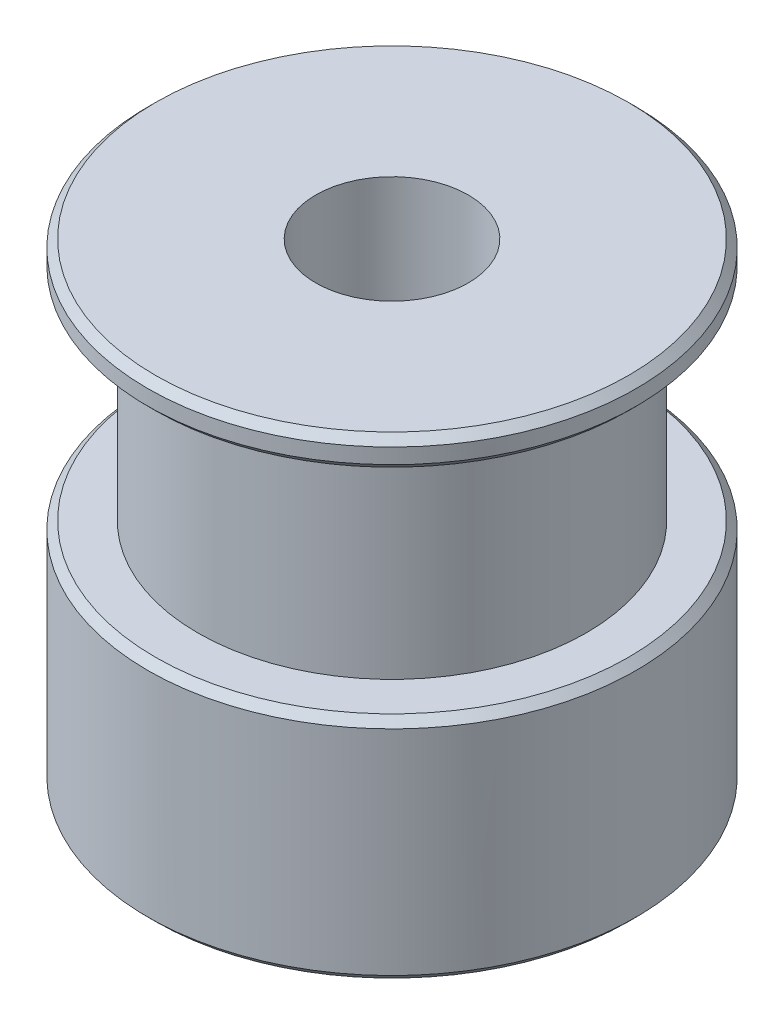
ISO-10303-21;
HEADER;
FILE_DESCRIPTION(('STEP AP214'),'2;1');
FILE_NAME('part.step','',(''),(''),'','','');
FILE_SCHEMA(('AUTOMOTIVE_DESIGN { 1 0 10303 214 1 1 1 1 }'));
ENDSEC;
DATA;
#1=APPLICATION_CONTEXT('core data for automotive mechanical design processes');
#2=APPLICATION_PROTOCOL_DEFINITION('international standard','automotive_design',2000,#1);
#3=PRODUCT_CONTEXT('',#1,'mechanical');
#4=PRODUCT('Part','Part','',(#3));
#5=PRODUCT_RELATED_PRODUCT_CATEGORY('part','',(#4));
#6=PRODUCT_DEFINITION_FORMATION('','',#4);
#7=PRODUCT_DEFINITION_CONTEXT('part definition',#1,'design');
#8=PRODUCT_DEFINITION('design','',#6,#7);
#9=PRODUCT_DEFINITION_SHAPE('','',#8);
#10=(LENGTH_UNIT() NAMED_UNIT(*) SI_UNIT(.MILLI.,.METRE.));
#11=(NAMED_UNIT(*) PLANE_ANGLE_UNIT() SI_UNIT($,.RADIAN.));
#12=(NAMED_UNIT(*) SI_UNIT($,.STERADIAN.) SOLID_ANGLE_UNIT());
#13=UNCERTAINTY_MEASURE_WITH_UNIT(LENGTH_MEASURE(1.E-05),#10,'distance_accuracy_value','');
#14=(GEOMETRIC_REPRESENTATION_CONTEXT(3) GLOBAL_UNCERTAINTY_ASSIGNED_CONTEXT((#13)) GLOBAL_UNIT_ASSIGNED_CONTEXT((#10,
#11,#12)) REPRESENTATION_CONTEXT('',''));
#15=CARTESIAN_POINT('',(0.,0.,0.));
#16=DIRECTION('',(0.,0.,1.));
#17=DIRECTION('',(1.,0.,0.));
#18=AXIS2_PLACEMENT_3D('',#15,#16,#17);
#19=CARTESIAN_POINT('',(0.,0.,0.));
#20=DIRECTION('',(0.,-1.,0.));
#21=DIRECTION('',(0.,0.,-1.));
#22=AXIS2_PLACEMENT_3D('',#19,#20,#21);
#23=CYLINDRICAL_SURFACE('',#22,2.5);
#24=CARTESIAN_POINT('',(0.,0.,0.));
#25=DIRECTION('',(0.,-1.,0.));
#26=DIRECTION('',(0.,0.,-1.));
#27=AXIS2_PLACEMENT_3D('',#24,#25,#26);
#28=CIRCLE('',#27,2.5);
#29=CARTESIAN_POINT('',(0.,0.,-2.5));
#30=VERTEX_POINT('',#29);
#31=EDGE_CURVE('E70',#30,#30,#28,.T.);
#32=ORIENTED_EDGE('',*,*,#31,.T.);
#33=EDGE_LOOP('',(#32));
#34=FACE_BOUND('',#33,.T.);
#35=CARTESIAN_POINT('',(0.,15.5,0.));
#36=DIRECTION('',(0.,-1.,0.));
#37=DIRECTION('',(0.,0.,-1.));
#38=AXIS2_PLACEMENT_3D('',#35,#36,#37);
#39=CIRCLE('',#38,2.5);
#40=CARTESIAN_POINT('',(0.,15.5,-2.5));
#41=VERTEX_POINT('',#40);
#42=EDGE_CURVE('E79',#41,#41,#39,.T.);
#43=ORIENTED_EDGE('',*,*,#42,.F.);
#44=EDGE_LOOP('',(#43));
#45=FACE_BOUND('',#44,.T.);
#46=ADVANCED_FACE('F37',(#34,#45),#23,.F.);
#47=CARTESIAN_POINT('',(2.5,0.,0.));
#48=DIRECTION('',(0.,-1.,0.));
#49=DIRECTION('',(0.,0.,-1.));
#50=AXIS2_PLACEMENT_3D('',#47,#48,#49);
#51=PLANE('',#50);
#52=CARTESIAN_POINT('',(0.,0.,0.));
#53=DIRECTION('',(0.,-1.,0.));
#54=DIRECTION('',(0.,0.,-1.));
#55=AXIS2_PLACEMENT_3D('',#52,#53,#54);
#56=CIRCLE('',#55,7.75);
#57=CARTESIAN_POINT('',(0.,0.,-7.75));
#58=VERTEX_POINT('',#57);
#59=EDGE_CURVE('E67',#58,#58,#56,.T.);
#60=ORIENTED_EDGE('',*,*,#59,.T.);
#61=EDGE_LOOP('',(#60));
#62=FACE_BOUND('',#61,.T.);
#63=ORIENTED_EDGE('',*,*,#31,.F.);
#64=EDGE_LOOP('',(#63));
#65=FACE_BOUND('',#64,.T.);
#66=ADVANCED_FACE('F86',(#62,#65),#51,.T.);
#67=CARTESIAN_POINT('',(0.,0.,0.));
#68=DIRECTION('',(0.,-1.,0.));
#69=DIRECTION('',(0.,0.,-1.));
#70=AXIS2_PLACEMENT_3D('',#67,#68,#69);
#71=CYLINDRICAL_SURFACE('',#70,8.);
#72=CARTESIAN_POINT('',(0.,0.250000000000004,0.));
#73=DIRECTION('',(0.,-1.,0.));
#74=DIRECTION('',(0.,0.,-1.));
#75=AXIS2_PLACEMENT_3D('',#72,#73,#74);
#76=CIRCLE('',#75,8.);
#77=CARTESIAN_POINT('',(0.,0.250000000000004,-8.));
#78=VERTEX_POINT('',#77);
#79=EDGE_CURVE('E61',#78,#78,#76,.F.);
#80=ORIENTED_EDGE('',*,*,#79,.T.);
#81=EDGE_LOOP('',(#80));
#82=FACE_BOUND('',#81,.T.);
#83=CARTESIAN_POINT('',(0.,7.25,0.));
#84=DIRECTION('',(0.,1.,0.));
#85=DIRECTION('',(0.,0.,1.));
#86=AXIS2_PLACEMENT_3D('',#83,#84,#85);
#87=CIRCLE('',#86,8.);
#88=CARTESIAN_POINT('',(0.,7.25,8.));
#89=VERTEX_POINT('',#88);
#90=EDGE_CURVE('E64',#89,#89,#87,.F.);
#91=ORIENTED_EDGE('',*,*,#90,.T.);
#92=EDGE_LOOP('',(#91));
#93=FACE_BOUND('',#92,.T.);
#94=ADVANCED_FACE('F92',(#82,#93),#71,.T.);
#95=CARTESIAN_POINT('',(8.,7.5,0.));
#96=DIRECTION('',(0.,1.,0.));
#97=DIRECTION('',(0.,0.,1.));
#98=AXIS2_PLACEMENT_3D('',#95,#96,#97);
#99=PLANE('',#98);
#100=CARTESIAN_POINT('',(0.,7.5,0.));
#101=DIRECTION('',(0.,1.,0.));
#102=DIRECTION('',(0.,0.,1.));
#103=AXIS2_PLACEMENT_3D('',#100,#101,#102);
#104=CIRCLE('',#103,7.75);
#105=CARTESIAN_POINT('',(0.,7.5,7.75));
#106=VERTEX_POINT('',#105);
#107=EDGE_CURVE('E58',#106,#106,#104,.T.);
#108=ORIENTED_EDGE('',*,*,#107,.T.);
#109=EDGE_LOOP('',(#108));
#110=FACE_BOUND('',#109,.T.);
#111=CARTESIAN_POINT('',(0.,7.5,0.));
#112=DIRECTION('',(0.,-1.,0.));
#113=DIRECTION('',(0.,0.,-1.));
#114=AXIS2_PLACEMENT_3D('',#111,#112,#113);
#115=CIRCLE('',#114,6.36619772367581);
#116=CARTESIAN_POINT('',(0.,7.5,-6.36619772367581));
#117=VERTEX_POINT('',#116);
#118=EDGE_CURVE('E73',#117,#117,#115,.T.);
#119=ORIENTED_EDGE('',*,*,#118,.T.);
#120=EDGE_LOOP('',(#119));
#121=FACE_BOUND('',#120,.T.);
#122=ADVANCED_FACE('F133',(#110,#121),#99,.T.);
#123=CARTESIAN_POINT('',(0.,0.,0.));
#124=DIRECTION('',(0.,-1.,0.));
#125=DIRECTION('',(0.,0.,-1.));
#126=AXIS2_PLACEMENT_3D('',#123,#124,#125);
#127=CYLINDRICAL_SURFACE('',#126,6.36619772367581);
#128=CARTESIAN_POINT('',(0.,14.5,0.));
#129=DIRECTION('',(0.,-1.,0.));
#130=DIRECTION('',(0.,0.,-1.));
#131=AXIS2_PLACEMENT_3D('',#128,#129,#130);
#132=CIRCLE('',#131,6.36619772367581);
#133=CARTESIAN_POINT('',(0.,14.5,-6.36619772367581));
#134=VERTEX_POINT('',#133);
#135=EDGE_CURVE('E76',#134,#134,#132,.T.);
#136=ORIENTED_EDGE('',*,*,#135,.T.);
#137=EDGE_LOOP('',(#136));
#138=FACE_BOUND('',#137,.T.);
#139=ORIENTED_EDGE('',*,*,#118,.F.);
#140=EDGE_LOOP('',(#139));
#141=FACE_BOUND('',#140,.T.);
#142=ADVANCED_FACE('F127',(#138,#141),#127,.T.);
#143=CARTESIAN_POINT('',(6.36619772367581,14.5,0.));
#144=DIRECTION('',(0.,-1.,0.));
#145=DIRECTION('',(0.,0.,-1.));
#146=AXIS2_PLACEMENT_3D('',#143,#144,#145);
#147=PLANE('',#146);
#148=CARTESIAN_POINT('',(0.,14.5,0.));
#149=DIRECTION('',(0.,-1.,0.));
#150=DIRECTION('',(0.,0.,-1.));
#151=AXIS2_PLACEMENT_3D('',#148,#149,#150);
#152=CIRCLE('',#151,7.75);
#153=CARTESIAN_POINT('',(0.,14.5,-7.75));
#154=VERTEX_POINT('',#153);
#155=EDGE_CURVE('E53',#154,#154,#152,.T.);
#156=ORIENTED_EDGE('',*,*,#155,.T.);
#157=EDGE_LOOP('',(#156));
#158=FACE_BOUND('',#157,.T.);
#159=ORIENTED_EDGE('',*,*,#135,.F.);
#160=EDGE_LOOP('',(#159));
#161=FACE_BOUND('',#160,.T.);
#162=ADVANCED_FACE('F123',(#158,#161),#147,.T.);
#163=CARTESIAN_POINT('',(0.,0.,0.));
#164=DIRECTION('',(0.,-1.,0.));
#165=DIRECTION('',(0.,0.,-1.));
#166=AXIS2_PLACEMENT_3D('',#163,#164,#165);
#167=CYLINDRICAL_SURFACE('',#166,8.);
#168=CARTESIAN_POINT('',(0.,14.75,0.));
#169=DIRECTION('',(0.,-1.,0.));
#170=DIRECTION('',(0.,0.,-1.));
#171=AXIS2_PLACEMENT_3D('',#168,#169,#170);
#172=CIRCLE('',#171,8.);
#173=CARTESIAN_POINT('',(0.,14.75,-8.));
#174=VERTEX_POINT('',#173);
#175=EDGE_CURVE('E45',#174,#174,#172,.F.);
#176=ORIENTED_EDGE('',*,*,#175,.T.);
#177=EDGE_LOOP('',(#176));
#178=FACE_BOUND('',#177,.T.);
#179=CARTESIAN_POINT('',(0.,15.25,0.));
#180=DIRECTION('',(0.,1.,0.));
#181=DIRECTION('',(0.,0.,1.));
#182=AXIS2_PLACEMENT_3D('',#179,#180,#181);
#183=CIRCLE('',#182,8.);
#184=CARTESIAN_POINT('',(0.,15.25,8.));
#185=VERTEX_POINT('',#184);
#186=EDGE_CURVE('E49',#185,#185,#183,.F.);
#187=ORIENTED_EDGE('',*,*,#186,.T.);
#188=EDGE_LOOP('',(#187));
#189=FACE_BOUND('',#188,.T.);
#190=ADVANCED_FACE('F126',(#178,#189),#167,.T.);
#191=CARTESIAN_POINT('',(8.,15.5,0.));
#192=DIRECTION('',(0.,1.,0.));
#193=DIRECTION('',(0.,0.,1.));
#194=AXIS2_PLACEMENT_3D('',#191,#192,#193);
#195=PLANE('',#194);
#196=CARTESIAN_POINT('',(0.,15.5,0.));
#197=DIRECTION('',(0.,1.,0.));
#198=DIRECTION('',(0.,0.,1.));
#199=AXIS2_PLACEMENT_3D('',#196,#197,#198);
#200=CIRCLE('',#199,7.75);
#201=CARTESIAN_POINT('',(0.,15.5,7.75));
#202=VERTEX_POINT('',#201);
#203=EDGE_CURVE('E10',#202,#202,#200,.T.);
#204=ORIENTED_EDGE('',*,*,#203,.T.);
#205=EDGE_LOOP('',(#204));
#206=FACE_BOUND('',#205,.T.);
#207=ORIENTED_EDGE('',*,*,#42,.T.);
#208=EDGE_LOOP('',(#207));
#209=FACE_BOUND('',#208,.T.);
#210=ADVANCED_FACE('F83',(#206,#209),#195,.T.);
#211=CARTESIAN_POINT('',(0.,0.,0.));
#212=DIRECTION('',(0.,1.,0.));
#213=DIRECTION('',(0.,0.,1.));
#214=AXIS2_PLACEMENT_3D('',#211,#212,#213);
#215=CONICAL_SURFACE('',#214,7.75,0.785398163397441);
#216=ORIENTED_EDGE('',*,*,#79,.F.);
#217=EDGE_LOOP('',(#216));
#218=FACE_BOUND('',#217,.T.);
#219=ORIENTED_EDGE('',*,*,#59,.F.);
#220=EDGE_LOOP('',(#219));
#221=FACE_BOUND('',#220,.T.);
#222=ADVANCED_FACE('F98',(#218,#221),#215,.T.);
#223=CARTESIAN_POINT('',(0.,7.25,0.));
#224=DIRECTION('',(0.,-1.,0.));
#225=DIRECTION('',(0.,0.,-1.));
#226=AXIS2_PLACEMENT_3D('',#223,#224,#225);
#227=CONICAL_SURFACE('',#226,8.,0.785398163397452);
#228=ORIENTED_EDGE('',*,*,#107,.F.);
#229=EDGE_LOOP('',(#228));
#230=FACE_BOUND('',#229,.T.);
#231=ORIENTED_EDGE('',*,*,#90,.F.);
#232=EDGE_LOOP('',(#231));
#233=FACE_BOUND('',#232,.T.);
#234=ADVANCED_FACE('F104',(#230,#233),#227,.T.);
#235=CARTESIAN_POINT('',(0.,14.5,0.));
#236=DIRECTION('',(0.,1.,0.));
#237=DIRECTION('',(0.,0.,1.));
#238=AXIS2_PLACEMENT_3D('',#235,#236,#237);
#239=CONICAL_SURFACE('',#238,7.75,0.785398163397441);
#240=ORIENTED_EDGE('',*,*,#175,.F.);
#241=EDGE_LOOP('',(#240));
#242=FACE_BOUND('',#241,.T.);
#243=ORIENTED_EDGE('',*,*,#155,.F.);
#244=EDGE_LOOP('',(#243));
#245=FACE_BOUND('',#244,.T.);
#246=ADVANCED_FACE('F110',(#242,#245),#239,.T.);
#247=CARTESIAN_POINT('',(0.,15.25,0.));
#248=DIRECTION('',(0.,-1.,0.));
#249=DIRECTION('',(0.,0.,-1.));
#250=AXIS2_PLACEMENT_3D('',#247,#248,#249);
#251=CONICAL_SURFACE('',#250,8.,0.785398163397455);
#252=ORIENTED_EDGE('',*,*,#203,.F.);
#253=EDGE_LOOP('',(#252));
#254=FACE_BOUND('',#253,.T.);
#255=ORIENTED_EDGE('',*,*,#186,.F.);
#256=EDGE_LOOP('',(#255));
#257=FACE_BOUND('',#256,.T.);
#258=ADVANCED_FACE('F40',(#254,#257),#251,.T.);
#259=CLOSED_SHELL('',(#46,#66,#94,#122,#142,#162,#190,#210,#222,#234,#246,#258));
#260=MANIFOLD_SOLID_BREP('B2',#259);
#261=ADVANCED_BREP_SHAPE_REPRESENTATION('',(#18,#260),#14);
#262=SHAPE_DEFINITION_REPRESENTATION(#9,#261);
ENDSEC;
END-ISO-10303-21;
